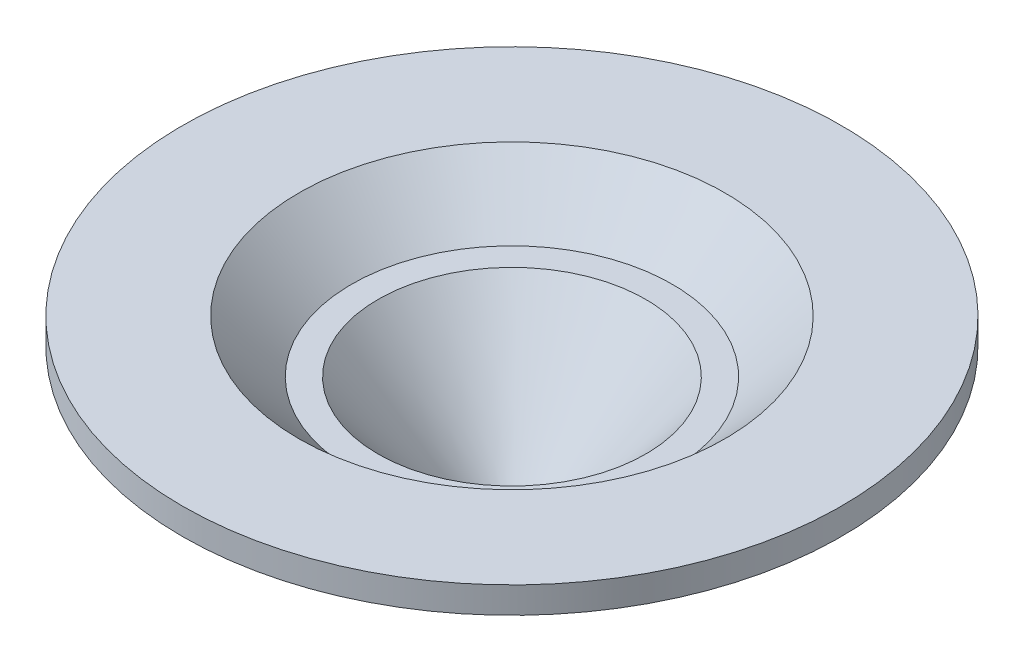
ISO-10303-21;
HEADER;
FILE_DESCRIPTION(('STEP AP214'),'2;1');
FILE_NAME('part.step','',(''),(''),'','','');
FILE_SCHEMA(('AUTOMOTIVE_DESIGN { 1 0 10303 214 1 1 1 1 }'));
ENDSEC;
DATA;
#1=APPLICATION_CONTEXT('core data for automotive mechanical design processes');
#2=APPLICATION_PROTOCOL_DEFINITION('international standard','automotive_design',2000,#1);
#3=PRODUCT_CONTEXT('',#1,'mechanical');
#4=PRODUCT('Part','Part','',(#3));
#5=PRODUCT_RELATED_PRODUCT_CATEGORY('part','',(#4));
#6=PRODUCT_DEFINITION_FORMATION('','',#4);
#7=PRODUCT_DEFINITION_CONTEXT('part definition',#1,'design');
#8=PRODUCT_DEFINITION('design','',#6,#7);
#9=PRODUCT_DEFINITION_SHAPE('','',#8);
#10=(LENGTH_UNIT() NAMED_UNIT(*) SI_UNIT(.MILLI.,.METRE.));
#11=(NAMED_UNIT(*) PLANE_ANGLE_UNIT() SI_UNIT($,.RADIAN.));
#12=(NAMED_UNIT(*) SI_UNIT($,.STERADIAN.) SOLID_ANGLE_UNIT());
#13=UNCERTAINTY_MEASURE_WITH_UNIT(LENGTH_MEASURE(1.E-05),#10,'distance_accuracy_value','');
#14=(GEOMETRIC_REPRESENTATION_CONTEXT(3) GLOBAL_UNCERTAINTY_ASSIGNED_CONTEXT((#13)) GLOBAL_UNIT_ASSIGNED_CONTEXT((#10,
#11,#12)) REPRESENTATION_CONTEXT('',''));
#15=CARTESIAN_POINT('',(0.,0.,0.));
#16=DIRECTION('',(0.,0.,1.));
#17=DIRECTION('',(1.,0.,0.));
#18=AXIS2_PLACEMENT_3D('',#15,#16,#17);
#19=CARTESIAN_POINT('',(0.,-5.,-2.5));
#20=DIRECTION('',(0.,1.,0.));
#21=DIRECTION('',(0.,0.,1.));
#22=AXIS2_PLACEMENT_3D('',#19,#20,#21);
#23=PLANE('',#22);
#24=CARTESIAN_POINT('',(0.,-5.,0.));
#25=DIRECTION('',(0.,1.,0.));
#26=DIRECTION('',(0.,0.,1.));
#27=AXIS2_PLACEMENT_3D('',#24,#25,#26);
#28=CIRCLE('',#27,2.5);
#29=CARTESIAN_POINT('',(0.,-5.,2.5));
#30=VERTEX_POINT('',#29);
#31=EDGE_CURVE('E10',#30,#30,#28,.T.);
#32=ORIENTED_EDGE('',*,*,#31,.F.);
#33=EDGE_LOOP('',(#32));
#34=FACE_BOUND('',#33,.T.);
#35=CARTESIAN_POINT('',(0.,-5.,0.));
#36=DIRECTION('',(0.,1.,0.));
#37=DIRECTION('',(0.,0.,1.));
#38=AXIS2_PLACEMENT_3D('',#35,#36,#37);
#39=CIRCLE('',#38,1.);
#40=CARTESIAN_POINT('',(0.,-5.,1.));
#41=VERTEX_POINT('',#40);
#42=EDGE_CURVE('E69',#41,#41,#39,.T.);
#43=ORIENTED_EDGE('',*,*,#42,.T.);
#44=EDGE_LOOP('',(#43));
#45=FACE_BOUND('',#44,.T.);
#46=ADVANCED_FACE('F35',(#34,#45),#23,.F.);
#47=CARTESIAN_POINT('',(0.,-5.,0.));
#48=DIRECTION('',(0.,1.,0.));
#49=DIRECTION('',(0.,0.,1.));
#50=AXIS2_PLACEMENT_3D('',#47,#48,#49);
#51=CONICAL_SURFACE('',#50,2.5,0.785398163397448);
#52=CARTESIAN_POINT('',(0.,-0.999999999999999,0.));
#53=DIRECTION('',(0.,1.,0.));
#54=DIRECTION('',(0.,0.,1.));
#55=AXIS2_PLACEMENT_3D('',#52,#53,#54);
#56=CIRCLE('',#55,6.5);
#57=CARTESIAN_POINT('',(0.,-0.999999999999999,6.5));
#58=VERTEX_POINT('',#57);
#59=EDGE_CURVE('E41',#58,#58,#56,.T.);
#60=ORIENTED_EDGE('',*,*,#59,.F.);
#61=EDGE_LOOP('',(#60));
#62=FACE_BOUND('',#61,.T.);
#63=ORIENTED_EDGE('',*,*,#31,.T.);
#64=EDGE_LOOP('',(#63));
#65=FACE_BOUND('',#64,.T.);
#66=ADVANCED_FACE('F118',(#62,#65),#51,.T.);
#67=CARTESIAN_POINT('',(0.,-0.999999999999999,-8.5));
#68=DIRECTION('',(0.,1.,0.));
#69=DIRECTION('',(0.,0.,1.));
#70=AXIS2_PLACEMENT_3D('',#67,#68,#69);
#71=PLANE('',#70);
#72=CARTESIAN_POINT('',(0.,-0.999999999999999,0.));
#73=DIRECTION('',(0.,1.,0.));
#74=DIRECTION('',(0.,0.,1.));
#75=AXIS2_PLACEMENT_3D('',#72,#73,#74);
#76=CIRCLE('',#75,8.5);
#77=CARTESIAN_POINT('',(0.,-0.999999999999999,8.5));
#78=VERTEX_POINT('',#77);
#79=EDGE_CURVE('E45',#78,#78,#76,.T.);
#80=ORIENTED_EDGE('',*,*,#79,.F.);
#81=EDGE_LOOP('',(#80));
#82=FACE_BOUND('',#81,.T.);
#83=ORIENTED_EDGE('',*,*,#59,.T.);
#84=EDGE_LOOP('',(#83));
#85=FACE_BOUND('',#84,.T.);
#86=ADVANCED_FACE('F113',(#82,#85),#71,.F.);
#87=CARTESIAN_POINT('',(0.,-0.999999999999999,0.));
#88=DIRECTION('',(0.,1.,0.));
#89=DIRECTION('',(0.,0.,1.));
#90=AXIS2_PLACEMENT_3D('',#87,#88,#89);
#91=CONICAL_SURFACE('',#90,8.5,0.785398163397449);
#92=CARTESIAN_POINT('',(0.,1.,0.));
#93=DIRECTION('',(0.,1.,0.));
#94=DIRECTION('',(0.,0.,1.));
#95=AXIS2_PLACEMENT_3D('',#92,#93,#94);
#96=CIRCLE('',#95,10.5);
#97=CARTESIAN_POINT('',(0.,1.,10.5));
#98=VERTEX_POINT('',#97);
#99=EDGE_CURVE('E49',#98,#98,#96,.T.);
#100=ORIENTED_EDGE('',*,*,#99,.F.);
#101=EDGE_LOOP('',(#100));
#102=FACE_BOUND('',#101,.T.);
#103=ORIENTED_EDGE('',*,*,#79,.T.);
#104=EDGE_LOOP('',(#103));
#105=FACE_BOUND('',#104,.T.);
#106=ADVANCED_FACE('F107',(#102,#105),#91,.T.);
#107=CARTESIAN_POINT('',(0.,1.,-12.5));
#108=DIRECTION('',(0.,1.,0.));
#109=DIRECTION('',(0.,0.,1.));
#110=AXIS2_PLACEMENT_3D('',#107,#108,#109);
#111=PLANE('',#110);
#112=CARTESIAN_POINT('',(0.,1.,0.));
#113=DIRECTION('',(0.,1.,0.));
#114=DIRECTION('',(0.,0.,1.));
#115=AXIS2_PLACEMENT_3D('',#112,#113,#114);
#116=CIRCLE('',#115,12.5);
#117=CARTESIAN_POINT('',(0.,1.,12.5));
#118=VERTEX_POINT('',#117);
#119=EDGE_CURVE('E54',#118,#118,#116,.T.);
#120=ORIENTED_EDGE('',*,*,#119,.F.);
#121=EDGE_LOOP('',(#120));
#122=FACE_BOUND('',#121,.T.);
#123=ORIENTED_EDGE('',*,*,#99,.T.);
#124=EDGE_LOOP('',(#123));
#125=FACE_BOUND('',#124,.T.);
#126=ADVANCED_FACE('F101',(#122,#125),#111,.F.);
#127=CARTESIAN_POINT('',(0.,0.,0.));
#128=DIRECTION('',(0.,1.,0.));
#129=DIRECTION('',(0.,0.,1.));
#130=AXIS2_PLACEMENT_3D('',#127,#128,#129);
#131=CYLINDRICAL_SURFACE('',#130,12.5);
#132=CARTESIAN_POINT('',(0.,2.,0.));
#133=DIRECTION('',(0.,1.,0.));
#134=DIRECTION('',(0.,0.,1.));
#135=AXIS2_PLACEMENT_3D('',#132,#133,#134);
#136=CIRCLE('',#135,12.5);
#137=CARTESIAN_POINT('',(0.,2.,12.5));
#138=VERTEX_POINT('',#137);
#139=EDGE_CURVE('E57',#138,#138,#136,.T.);
#140=ORIENTED_EDGE('',*,*,#139,.F.);
#141=EDGE_LOOP('',(#140));
#142=FACE_BOUND('',#141,.T.);
#143=ORIENTED_EDGE('',*,*,#119,.T.);
#144=EDGE_LOOP('',(#143));
#145=FACE_BOUND('',#144,.T.);
#146=ADVANCED_FACE('F95',(#142,#145),#131,.T.);
#147=CARTESIAN_POINT('',(0.,2.,-8.08032128514056));
#148=DIRECTION('',(0.,-1.,0.));
#149=DIRECTION('',(0.,0.,-1.));
#150=AXIS2_PLACEMENT_3D('',#147,#148,#149);
#151=PLANE('',#150);
#152=CARTESIAN_POINT('',(0.,2.,0.));
#153=DIRECTION('',(0.,1.,0.));
#154=DIRECTION('',(0.,0.,1.));
#155=AXIS2_PLACEMENT_3D('',#152,#153,#154);
#156=CIRCLE('',#155,8.08032128514056);
#157=CARTESIAN_POINT('',(0.,2.,8.08032128514056));
#158=VERTEX_POINT('',#157);
#159=EDGE_CURVE('E60',#158,#158,#156,.T.);
#160=ORIENTED_EDGE('',*,*,#159,.F.);
#161=EDGE_LOOP('',(#160));
#162=FACE_BOUND('',#161,.T.);
#163=ORIENTED_EDGE('',*,*,#139,.T.);
#164=EDGE_LOOP('',(#163));
#165=FACE_BOUND('',#164,.T.);
#166=ADVANCED_FACE('F89',(#162,#165),#151,.F.);
#167=CARTESIAN_POINT('',(0.,2.,0.));
#168=DIRECTION('',(0.,1.,0.));
#169=DIRECTION('',(0.,0.,1.));
#170=AXIS2_PLACEMENT_3D('',#167,#168,#169);
#171=CONICAL_SURFACE('',#170,8.08032128514056,0.785398163397448);
#172=CARTESIAN_POINT('',(0.,0.,0.));
#173=DIRECTION('',(0.,1.,0.));
#174=DIRECTION('',(0.,0.,1.));
#175=AXIS2_PLACEMENT_3D('',#172,#173,#174);
#176=CIRCLE('',#175,6.08032128514056);
#177=CARTESIAN_POINT('',(0.,0.,6.08032128514056));
#178=VERTEX_POINT('',#177);
#179=EDGE_CURVE('E63',#178,#178,#176,.T.);
#180=ORIENTED_EDGE('',*,*,#179,.F.);
#181=EDGE_LOOP('',(#180));
#182=FACE_BOUND('',#181,.T.);
#183=ORIENTED_EDGE('',*,*,#159,.T.);
#184=EDGE_LOOP('',(#183));
#185=FACE_BOUND('',#184,.T.);
#186=ADVANCED_FACE('F83',(#182,#185),#171,.F.);
#187=CARTESIAN_POINT('',(0.,0.,-5.08032128514056));
#188=DIRECTION('',(0.,-1.,0.));
#189=DIRECTION('',(0.,0.,-1.));
#190=AXIS2_PLACEMENT_3D('',#187,#188,#189);
#191=PLANE('',#190);
#192=CARTESIAN_POINT('',(0.,0.,0.));
#193=DIRECTION('',(0.,1.,0.));
#194=DIRECTION('',(0.,0.,1.));
#195=AXIS2_PLACEMENT_3D('',#192,#193,#194);
#196=CIRCLE('',#195,5.08032128514056);
#197=CARTESIAN_POINT('',(0.,0.,5.08032128514056));
#198=VERTEX_POINT('',#197);
#199=EDGE_CURVE('E66',#198,#198,#196,.T.);
#200=ORIENTED_EDGE('',*,*,#199,.F.);
#201=EDGE_LOOP('',(#200));
#202=FACE_BOUND('',#201,.T.);
#203=ORIENTED_EDGE('',*,*,#179,.T.);
#204=EDGE_LOOP('',(#203));
#205=FACE_BOUND('',#204,.T.);
#206=ADVANCED_FACE('F77',(#202,#205),#191,.F.);
#207=CARTESIAN_POINT('',(0.,0.,0.));
#208=DIRECTION('',(0.,1.,0.));
#209=DIRECTION('',(0.,0.,1.));
#210=AXIS2_PLACEMENT_3D('',#207,#208,#209);
#211=CONICAL_SURFACE('',#210,5.08032128514056,0.68445975371838);
#212=ORIENTED_EDGE('',*,*,#42,.F.);
#213=EDGE_LOOP('',(#212));
#214=FACE_BOUND('',#213,.T.);
#215=ORIENTED_EDGE('',*,*,#199,.T.);
#216=EDGE_LOOP('',(#215));
#217=FACE_BOUND('',#216,.T.);
#218=ADVANCED_FACE('F74',(#214,#217),#211,.F.);
#219=CLOSED_SHELL('',(#46,#66,#86,#106,#126,#146,#166,#186,#206,#218));
#220=MANIFOLD_SOLID_BREP('B2',#219);
#221=ADVANCED_BREP_SHAPE_REPRESENTATION('',(#18,#220),#14);
#222=SHAPE_DEFINITION_REPRESENTATION(#9,#221);
ENDSEC;
END-ISO-10303-21;
